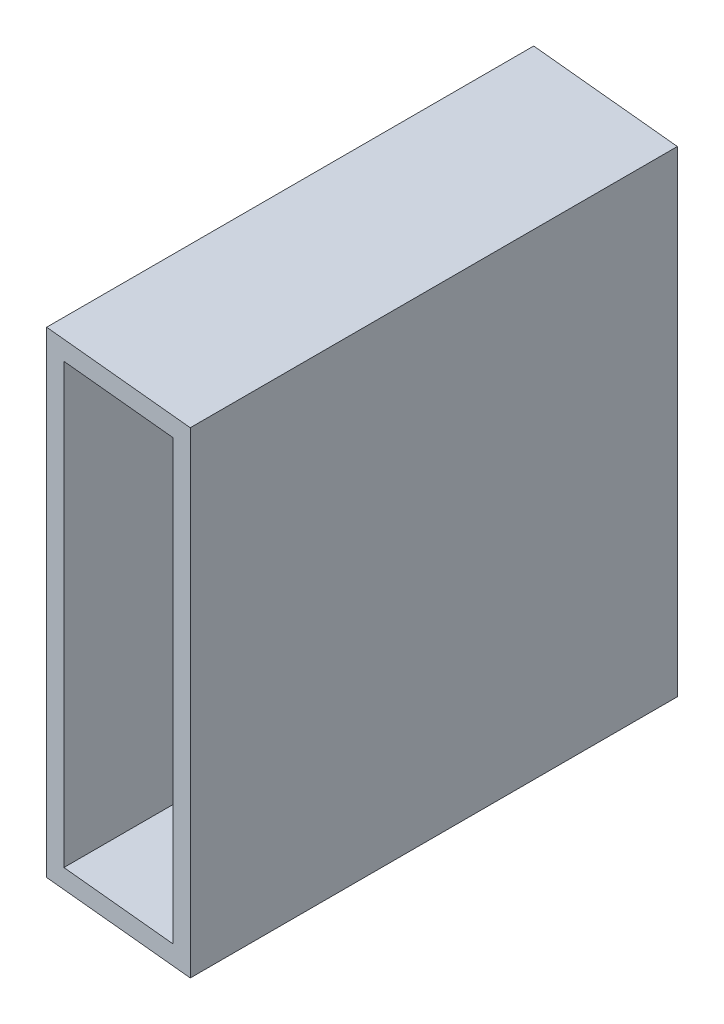
ISO-10303-21;
HEADER;
FILE_DESCRIPTION(('STEP AP214'),'2;1');
FILE_NAME('part.step','',(''),(''),'','','');
FILE_SCHEMA(('AUTOMOTIVE_DESIGN { 1 0 10303 214 1 1 1 1 }'));
ENDSEC;
DATA;
#1=APPLICATION_CONTEXT('core data for automotive mechanical design processes');
#2=APPLICATION_PROTOCOL_DEFINITION('international standard','automotive_design',2000,#1);
#3=PRODUCT_CONTEXT('',#1,'mechanical');
#4=PRODUCT('Part','Part','',(#3));
#5=PRODUCT_RELATED_PRODUCT_CATEGORY('part','',(#4));
#6=PRODUCT_DEFINITION_FORMATION('','',#4);
#7=PRODUCT_DEFINITION_CONTEXT('part definition',#1,'design');
#8=PRODUCT_DEFINITION('design','',#6,#7);
#9=PRODUCT_DEFINITION_SHAPE('','',#8);
#10=(LENGTH_UNIT() NAMED_UNIT(*) SI_UNIT(.MILLI.,.METRE.));
#11=(NAMED_UNIT(*) PLANE_ANGLE_UNIT() SI_UNIT($,.RADIAN.));
#12=(NAMED_UNIT(*) SI_UNIT($,.STERADIAN.) SOLID_ANGLE_UNIT());
#13=UNCERTAINTY_MEASURE_WITH_UNIT(LENGTH_MEASURE(1.E-05),#10,'distance_accuracy_value','');
#14=(GEOMETRIC_REPRESENTATION_CONTEXT(3) GLOBAL_UNCERTAINTY_ASSIGNED_CONTEXT((#13)) GLOBAL_UNIT_ASSIGNED_CONTEXT((#10,
#11,#12)) REPRESENTATION_CONTEXT('',''));
#15=CARTESIAN_POINT('',(0.,0.,0.));
#16=DIRECTION('',(0.,0.,1.));
#17=DIRECTION('',(1.,0.,0.));
#18=AXIS2_PLACEMENT_3D('',#15,#16,#17);
#19=CARTESIAN_POINT('',(12.7000000000001,0.,77.8822786353849));
#20=DIRECTION('',(-1.,0.,0.));
#21=DIRECTION('',(0.,-1.,0.));
#22=AXIS2_PLACEMENT_3D('',#19,#20,#21);
#23=PLANE('',#22);
#24=DIRECTION('',(0.,0.,-1.));
#25=VECTOR('',#24,1.);
#26=CARTESIAN_POINT('',(12.7,38.1,77.8822786353849));
#27=LINE('',#26,#25);
#28=CARTESIAN_POINT('',(12.7,38.1,79.1000667705779));
#29=VERTEX_POINT('',#28);
#30=CARTESIAN_POINT('',(12.7,38.1,1.217788135193));
#31=VERTEX_POINT('',#30);
#32=EDGE_CURVE('E42',#29,#31,#27,.T.);
#33=ORIENTED_EDGE('',*,*,#32,.F.);
#34=DIRECTION('',(0.,-1.,0.));
#35=VECTOR('',#34,1.);
#36=CARTESIAN_POINT('',(12.7000000000001,0.,79.1000667705779));
#37=LINE('',#36,#35);
#38=CARTESIAN_POINT('',(12.7,-38.1,79.1000667705779));
#39=VERTEX_POINT('',#38);
#40=EDGE_CURVE('E99',#29,#39,#37,.T.);
#41=ORIENTED_EDGE('',*,*,#40,.T.);
#42=DIRECTION('',(0.,0.,-1.));
#43=VECTOR('',#42,1.);
#44=CARTESIAN_POINT('',(12.7,-38.1,77.8822786353849));
#45=LINE('',#44,#43);
#46=CARTESIAN_POINT('',(12.7,-38.1,1.21778813519302));
#47=VERTEX_POINT('',#46);
#48=EDGE_CURVE('E118',#39,#47,#45,.T.);
#49=ORIENTED_EDGE('',*,*,#48,.T.);
#50=DIRECTION('',(0.,-1.,0.));
#51=VECTOR('',#50,1.);
#52=CARTESIAN_POINT('',(12.7000000000001,0.,1.21778813519302));
#53=LINE('',#52,#51);
#54=EDGE_CURVE('E125',#31,#47,#53,.T.);
#55=ORIENTED_EDGE('',*,*,#54,.F.);
#56=EDGE_LOOP('',(#33,#41,#49,#55));
#57=FACE_BOUND('',#56,.T.);
#58=ADVANCED_FACE('F34',(#57),#23,.F.);
#59=CARTESIAN_POINT('',(0.,38.1,77.8822786353849));
#60=DIRECTION('',(0.,1.,0.));
#61=DIRECTION('',(0.,0.,1.));
#62=AXIS2_PLACEMENT_3D('',#59,#60,#61);
#63=PLANE('',#62);
#64=DIRECTION('',(0.995434128422968,0.,0.0954510134613935));
#65=VECTOR('',#64,1.);
#66=CARTESIAN_POINT('',(-7.39999999999999,38.1,77.1727012967685));
#67=LINE('',#66,#65);
#68=CARTESIAN_POINT('',(-12.7,38.1,76.6644905001919));
#69=VERTEX_POINT('',#68);
#70=EDGE_CURVE('E96',#69,#29,#67,.T.);
#71=ORIENTED_EDGE('',*,*,#70,.T.);
#72=ORIENTED_EDGE('',*,*,#32,.T.);
#73=DIRECTION('',(-0.995434128422968,0.,-0.0954510134613937));
#74=VECTOR('',#73,1.);
#75=CARTESIAN_POINT('',(7.4,38.1,0.709577338616388));
#76=LINE('',#75,#74);
#77=CARTESIAN_POINT('',(-12.7,38.1,-1.21778813519303));
#78=VERTEX_POINT('',#77);
#79=EDGE_CURVE('E115',#31,#78,#76,.T.);
#80=ORIENTED_EDGE('',*,*,#79,.T.);
#81=DIRECTION('',(0.,0.,-1.));
#82=VECTOR('',#81,1.);
#83=CARTESIAN_POINT('',(-12.7,38.1,77.8822786353849));
#84=LINE('',#83,#82);
#85=EDGE_CURVE('E108',#69,#78,#84,.T.);
#86=ORIENTED_EDGE('',*,*,#85,.F.);
#87=EDGE_LOOP('',(#71,#72,#80,#86));
#88=FACE_BOUND('',#87,.T.);
#89=ADVANCED_FACE('F113',(#88),#63,.T.);
#90=CARTESIAN_POINT('',(-12.7,0.,77.8822786353849));
#91=DIRECTION('',(-1.,0.,0.));
#92=DIRECTION('',(0.,0.,1.));
#93=AXIS2_PLACEMENT_3D('',#90,#91,#92);
#94=PLANE('',#93);
#95=DIRECTION('',(0.,-1.,0.));
#96=VECTOR('',#95,1.);
#97=CARTESIAN_POINT('',(-12.7,0.,76.6644905001919));
#98=LINE('',#97,#96);
#99=CARTESIAN_POINT('',(-12.7,-38.1,76.6644905001919));
#100=VERTEX_POINT('',#99);
#101=EDGE_CURVE('E56',#69,#100,#98,.T.);
#102=ORIENTED_EDGE('',*,*,#101,.F.);
#103=ORIENTED_EDGE('',*,*,#85,.T.);
#104=DIRECTION('',(0.,-1.,0.));
#105=VECTOR('',#104,1.);
#106=CARTESIAN_POINT('',(-12.7,0.,-1.21778813519303));
#107=LINE('',#106,#105);
#108=CARTESIAN_POINT('',(-12.7,-38.1,-1.21778813519303));
#109=VERTEX_POINT('',#108);
#110=EDGE_CURVE('E141',#78,#109,#107,.T.);
#111=ORIENTED_EDGE('',*,*,#110,.T.);
#112=DIRECTION('',(0.,0.,-1.));
#113=VECTOR('',#112,1.);
#114=CARTESIAN_POINT('',(-12.7,-38.1,77.8822786353849));
#115=LINE('',#114,#113);
#116=EDGE_CURVE('E110',#100,#109,#115,.T.);
#117=ORIENTED_EDGE('',*,*,#116,.F.);
#118=EDGE_LOOP('',(#102,#103,#111,#117));
#119=FACE_BOUND('',#118,.T.);
#120=ADVANCED_FACE('F106',(#119),#94,.T.);
#121=CARTESIAN_POINT('',(9.652,0.,77.8822786353849));
#122=DIRECTION('',(1.,0.,0.));
#123=DIRECTION('',(0.,1.,0.));
#124=AXIS2_PLACEMENT_3D('',#121,#122,#123);
#125=PLANE('',#124);
#126=DIRECTION('',(0.,0.,-1.));
#127=VECTOR('',#126,1.);
#128=CARTESIAN_POINT('',(9.652,-35.052,77.8822786353849));
#129=LINE('',#128,#127);
#130=CARTESIAN_POINT('',(9.652,-35.052,78.8077976181316));
#131=VERTEX_POINT('',#130);
#132=CARTESIAN_POINT('',(9.652,-35.052,0.92551898274668));
#133=VERTEX_POINT('',#132);
#134=EDGE_CURVE('E128',#131,#133,#129,.T.);
#135=ORIENTED_EDGE('',*,*,#134,.F.);
#136=DIRECTION('',(0.,1.,0.));
#137=VECTOR('',#136,1.);
#138=CARTESIAN_POINT('',(9.652,0.,78.8077976181316));
#139=LINE('',#138,#137);
#140=CARTESIAN_POINT('',(9.652,35.052,78.8077976181316));
#141=VERTEX_POINT('',#140);
#142=EDGE_CURVE('E157',#131,#141,#139,.T.);
#143=ORIENTED_EDGE('',*,*,#142,.T.);
#144=DIRECTION('',(0.,0.,-1.));
#145=VECTOR('',#144,1.);
#146=CARTESIAN_POINT('',(9.65199999999999,35.052,77.8822786353849));
#147=LINE('',#146,#145);
#148=CARTESIAN_POINT('',(9.652,35.052,0.925518982746691));
#149=VERTEX_POINT('',#148);
#150=EDGE_CURVE('E122',#141,#149,#147,.T.);
#151=ORIENTED_EDGE('',*,*,#150,.T.);
#152=DIRECTION('',(0.,1.,0.));
#153=VECTOR('',#152,1.);
#154=CARTESIAN_POINT('',(9.652,0.,0.925518982746704));
#155=LINE('',#154,#153);
#156=EDGE_CURVE('E143',#133,#149,#155,.T.);
#157=ORIENTED_EDGE('',*,*,#156,.F.);
#158=EDGE_LOOP('',(#135,#143,#151,#157));
#159=FACE_BOUND('',#158,.T.);
#160=ADVANCED_FACE('F36',(#159),#125,.F.);
#161=CARTESIAN_POINT('',(0.,-35.052,77.8822786353849));
#162=DIRECTION('',(0.,1.,0.));
#163=DIRECTION('',(-1.,0.,0.));
#164=AXIS2_PLACEMENT_3D('',#161,#162,#163);
#165=PLANE('',#164);
#166=DIRECTION('',(-0.995434128422968,0.,-0.0954510134613935));
#167=VECTOR('',#166,1.);
#168=CARTESIAN_POINT('',(0.,-35.052,77.8822786353849));
#169=LINE('',#168,#167);
#170=CARTESIAN_POINT('',(-9.65199999999999,-35.052,76.9567596526382));
#171=VERTEX_POINT('',#170);
#172=EDGE_CURVE('E160',#131,#171,#169,.T.);
#173=ORIENTED_EDGE('',*,*,#172,.F.);
#174=ORIENTED_EDGE('',*,*,#134,.T.);
#175=DIRECTION('',(-0.995434128422968,0.,-0.0954510134613937));
#176=VECTOR('',#175,1.);
#177=CARTESIAN_POINT('',(7.39999999999999,-35.052,0.709577338616388));
#178=LINE('',#177,#176);
#179=CARTESIAN_POINT('',(-9.65199999999999,-35.052,-0.925518982746689));
#180=VERTEX_POINT('',#179);
#181=EDGE_CURVE('E146',#133,#180,#178,.T.);
#182=ORIENTED_EDGE('',*,*,#181,.T.);
#183=DIRECTION('',(0.,0.,-1.));
#184=VECTOR('',#183,1.);
#185=CARTESIAN_POINT('',(-9.65199999999999,-35.052,77.8822786353849));
#186=LINE('',#185,#184);
#187=EDGE_CURVE('E127',#171,#180,#186,.T.);
#188=ORIENTED_EDGE('',*,*,#187,.F.);
#189=EDGE_LOOP('',(#173,#174,#182,#188));
#190=FACE_BOUND('',#189,.T.);
#191=ADVANCED_FACE('F193',(#190),#165,.T.);
#192=CARTESIAN_POINT('',(-9.65199999999999,0.,77.8822786353849));
#193=DIRECTION('',(1.,0.,0.));
#194=DIRECTION('',(0.,1.,0.));
#195=AXIS2_PLACEMENT_3D('',#192,#193,#194);
#196=PLANE('',#195);
#197=DIRECTION('',(0.,1.,0.));
#198=VECTOR('',#197,1.);
#199=CARTESIAN_POINT('',(-9.65199999999999,0.,76.9567596526382));
#200=LINE('',#199,#198);
#201=CARTESIAN_POINT('',(-9.652,35.052,76.9567596526382));
#202=VERTEX_POINT('',#201);
#203=EDGE_CURVE('E49',#171,#202,#200,.T.);
#204=ORIENTED_EDGE('',*,*,#203,.F.);
#205=ORIENTED_EDGE('',*,*,#187,.T.);
#206=DIRECTION('',(0.,1.,0.));
#207=VECTOR('',#206,1.);
#208=CARTESIAN_POINT('',(-9.65199999999999,0.,-0.92551898274669));
#209=LINE('',#208,#207);
#210=CARTESIAN_POINT('',(-9.65199999999999,35.052,-0.92551898274672));
#211=VERTEX_POINT('',#210);
#212=EDGE_CURVE('E148',#180,#211,#209,.T.);
#213=ORIENTED_EDGE('',*,*,#212,.T.);
#214=DIRECTION('',(0.,0.,-1.));
#215=VECTOR('',#214,1.);
#216=CARTESIAN_POINT('',(-9.65199999999999,35.052,77.8822786353849));
#217=LINE('',#216,#215);
#218=EDGE_CURVE('E124',#202,#211,#217,.T.);
#219=ORIENTED_EDGE('',*,*,#218,.F.);
#220=EDGE_LOOP('',(#204,#205,#213,#219));
#221=FACE_BOUND('',#220,.T.);
#222=ADVANCED_FACE('F190',(#221),#196,.T.);
#223=CARTESIAN_POINT('',(0.,35.052,77.8822786353849));
#224=DIRECTION('',(0.,1.,0.));
#225=DIRECTION('',(0.,0.,1.));
#226=AXIS2_PLACEMENT_3D('',#223,#224,#225);
#227=PLANE('',#226);
#228=ORIENTED_EDGE('',*,*,#150,.F.);
#229=DIRECTION('',(-0.995434128422968,0.,-0.0954510134613935));
#230=VECTOR('',#229,1.);
#231=CARTESIAN_POINT('',(0.,35.052,77.8822786353849));
#232=LINE('',#231,#230);
#233=EDGE_CURVE('E163',#141,#202,#232,.T.);
#234=ORIENTED_EDGE('',*,*,#233,.T.);
#235=ORIENTED_EDGE('',*,*,#218,.T.);
#236=DIRECTION('',(-0.995434128422968,0.,-0.0954510134613937));
#237=VECTOR('',#236,1.);
#238=CARTESIAN_POINT('',(7.4,35.052,0.709577338616388));
#239=LINE('',#238,#237);
#240=EDGE_CURVE('E151',#149,#211,#239,.T.);
#241=ORIENTED_EDGE('',*,*,#240,.F.);
#242=EDGE_LOOP('',(#228,#234,#235,#241));
#243=FACE_BOUND('',#242,.T.);
#244=ADVANCED_FACE('F178',(#243),#227,.F.);
#245=CARTESIAN_POINT('',(0.,-38.1,77.8822786353849));
#246=DIRECTION('',(0.,-1.,0.));
#247=DIRECTION('',(0.,0.,-1.));
#248=AXIS2_PLACEMENT_3D('',#245,#246,#247);
#249=PLANE('',#248);
#250=DIRECTION('',(0.995434128422968,0.,0.0954510134613935));
#251=VECTOR('',#250,1.);
#252=CARTESIAN_POINT('',(0.,-38.1,77.8822786353849));
#253=LINE('',#252,#251);
#254=EDGE_CURVE('E11',#100,#39,#253,.T.);
#255=ORIENTED_EDGE('',*,*,#254,.F.);
#256=ORIENTED_EDGE('',*,*,#116,.T.);
#257=DIRECTION('',(-0.995434128422968,0.,-0.0954510134613937));
#258=VECTOR('',#257,1.);
#259=CARTESIAN_POINT('',(0.,-38.1,0.));
#260=LINE('',#259,#258);
#261=EDGE_CURVE('E154',#47,#109,#260,.T.);
#262=ORIENTED_EDGE('',*,*,#261,.F.);
#263=ORIENTED_EDGE('',*,*,#48,.F.);
#264=EDGE_LOOP('',(#255,#256,#262,#263));
#265=FACE_BOUND('',#264,.T.);
#266=ADVANCED_FACE('F167',(#265),#249,.T.);
#267=CARTESIAN_POINT('',(0.,-38.1,0.));
#268=DIRECTION('',(0.0954510134613937,0.,-0.995434128422967));
#269=DIRECTION('',(-0.995434128422968,0.,-0.0954510134613937));
#270=AXIS2_PLACEMENT_3D('',#267,#268,#269);
#271=PLANE('',#270);
#272=ORIENTED_EDGE('',*,*,#156,.T.);
#273=ORIENTED_EDGE('',*,*,#240,.T.);
#274=ORIENTED_EDGE('',*,*,#212,.F.);
#275=ORIENTED_EDGE('',*,*,#181,.F.);
#276=EDGE_LOOP('',(#272,#273,#274,#275));
#277=FACE_BOUND('',#276,.T.);
#278=ORIENTED_EDGE('',*,*,#54,.T.);
#279=ORIENTED_EDGE('',*,*,#261,.T.);
#280=ORIENTED_EDGE('',*,*,#110,.F.);
#281=ORIENTED_EDGE('',*,*,#79,.F.);
#282=EDGE_LOOP('',(#278,#279,#280,#281));
#283=FACE_BOUND('',#282,.T.);
#284=ADVANCED_FACE('F169',(#277,#283),#271,.T.);
#285=CARTESIAN_POINT('',(-7.39999999999999,38.1,77.1727012967685));
#286=DIRECTION('',(0.0954510134613935,0.,-0.995434128422968));
#287=DIRECTION('',(-0.995434128422968,0.,-0.0954510134613935));
#288=AXIS2_PLACEMENT_3D('',#285,#286,#287);
#289=PLANE('',#288);
#290=ORIENTED_EDGE('',*,*,#70,.F.);
#291=ORIENTED_EDGE('',*,*,#101,.T.);
#292=ORIENTED_EDGE('',*,*,#254,.T.);
#293=ORIENTED_EDGE('',*,*,#40,.F.);
#294=EDGE_LOOP('',(#290,#291,#292,#293));
#295=FACE_BOUND('',#294,.T.);
#296=ORIENTED_EDGE('',*,*,#172,.T.);
#297=ORIENTED_EDGE('',*,*,#203,.T.);
#298=ORIENTED_EDGE('',*,*,#233,.F.);
#299=ORIENTED_EDGE('',*,*,#142,.F.);
#300=EDGE_LOOP('',(#296,#297,#298,#299));
#301=FACE_BOUND('',#300,.T.);
#302=ADVANCED_FACE('F97',(#295,#301),#289,.F.);
#303=CLOSED_SHELL('',(#58,#89,#120,#160,#191,#222,#244,#266,#284,#302));
#304=MANIFOLD_SOLID_BREP('B2',#303);
#305=ADVANCED_BREP_SHAPE_REPRESENTATION('',(#18,#304),#14);
#306=SHAPE_DEFINITION_REPRESENTATION(#9,#305);
ENDSEC;
END-ISO-10303-21;
